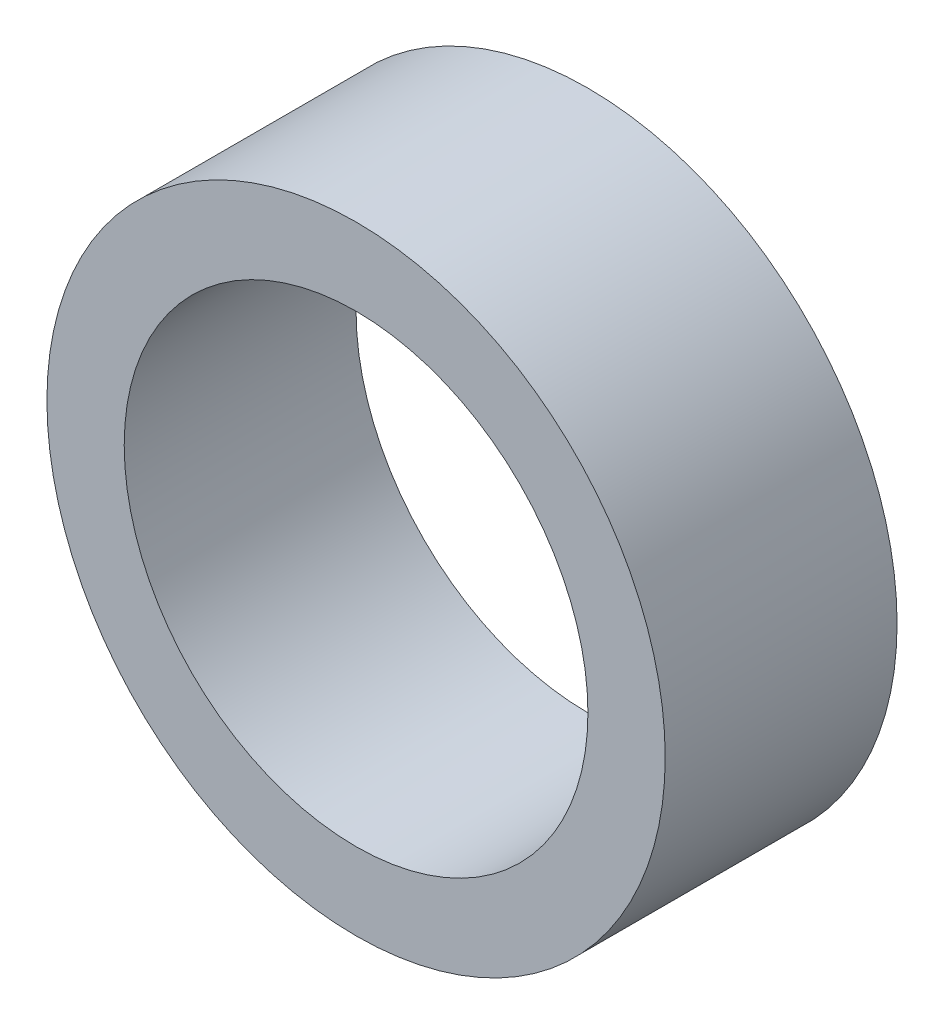
ISO-10303-21;
HEADER;
FILE_DESCRIPTION(('STEP AP214'),'2;1');
FILE_NAME('part.step','',(''),(''),'','','');
FILE_SCHEMA(('AUTOMOTIVE_DESIGN { 1 0 10303 214 1 1 1 1 }'));
ENDSEC;
DATA;
#1=APPLICATION_CONTEXT('core data for automotive mechanical design processes');
#2=APPLICATION_PROTOCOL_DEFINITION('international standard','automotive_design',2000,#1);
#3=PRODUCT_CONTEXT('',#1,'mechanical');
#4=PRODUCT('Part','Part','',(#3));
#5=PRODUCT_RELATED_PRODUCT_CATEGORY('part','',(#4));
#6=PRODUCT_DEFINITION_FORMATION('','',#4);
#7=PRODUCT_DEFINITION_CONTEXT('part definition',#1,'design');
#8=PRODUCT_DEFINITION('design','',#6,#7);
#9=PRODUCT_DEFINITION_SHAPE('','',#8);
#10=(LENGTH_UNIT() NAMED_UNIT(*) SI_UNIT(.MILLI.,.METRE.));
#11=(NAMED_UNIT(*) PLANE_ANGLE_UNIT() SI_UNIT($,.RADIAN.));
#12=(NAMED_UNIT(*) SI_UNIT($,.STERADIAN.) SOLID_ANGLE_UNIT());
#13=UNCERTAINTY_MEASURE_WITH_UNIT(LENGTH_MEASURE(1.E-05),#10,'distance_accuracy_value','');
#14=(GEOMETRIC_REPRESENTATION_CONTEXT(3) GLOBAL_UNCERTAINTY_ASSIGNED_CONTEXT((#13)) GLOBAL_UNIT_ASSIGNED_CONTEXT((#10,
#11,#12)) REPRESENTATION_CONTEXT('',''));
#15=CARTESIAN_POINT('',(0.,0.,0.));
#16=DIRECTION('',(0.,0.,1.));
#17=DIRECTION('',(1.,0.,0.));
#18=AXIS2_PLACEMENT_3D('',#15,#16,#17);
#19=CARTESIAN_POINT('',(0.,0.,4.7625));
#20=DIRECTION('',(0.,0.,1.));
#21=DIRECTION('',(1.,0.,0.));
#22=AXIS2_PLACEMENT_3D('',#19,#20,#21);
#23=PLANE('',#22);
#24=CARTESIAN_POINT('',(0.,0.,4.7625));
#25=DIRECTION('',(0.,0.,1.));
#26=DIRECTION('',(1.,0.,0.));
#27=AXIS2_PLACEMENT_3D('',#24,#25,#26);
#28=CIRCLE('',#27,12.7);
#29=CARTESIAN_POINT('',(12.7,0.,4.7625));
#30=VERTEX_POINT('',#29);
#31=EDGE_CURVE('E10',#30,#30,#28,.T.);
#32=ORIENTED_EDGE('',*,*,#31,.T.);
#33=EDGE_LOOP('',(#32));
#34=FACE_BOUND('',#33,.T.);
#35=CARTESIAN_POINT('',(0.,0.,4.7625));
#36=DIRECTION('',(0.,0.,1.));
#37=DIRECTION('',(1.,0.,0.));
#38=AXIS2_PLACEMENT_3D('',#35,#36,#37);
#39=CIRCLE('',#38,9.525);
#40=CARTESIAN_POINT('',(9.525,0.,4.7625));
#41=VERTEX_POINT('',#40);
#42=EDGE_CURVE('E45',#41,#41,#39,.T.);
#43=ORIENTED_EDGE('',*,*,#42,.F.);
#44=EDGE_LOOP('',(#43));
#45=FACE_BOUND('',#44,.T.);
#46=ADVANCED_FACE('F34',(#34,#45),#23,.T.);
#47=CARTESIAN_POINT('',(0.,0.,-4.7625));
#48=DIRECTION('',(0.,0.,1.));
#49=DIRECTION('',(1.,0.,0.));
#50=AXIS2_PLACEMENT_3D('',#47,#48,#49);
#51=PLANE('',#50);
#52=CARTESIAN_POINT('',(0.,0.,-4.7625));
#53=DIRECTION('',(0.,0.,1.));
#54=DIRECTION('',(1.,0.,0.));
#55=AXIS2_PLACEMENT_3D('',#52,#53,#54);
#56=CIRCLE('',#55,12.7);
#57=CARTESIAN_POINT('',(12.7,0.,-4.7625));
#58=VERTEX_POINT('',#57);
#59=EDGE_CURVE('E38',#58,#58,#56,.T.);
#60=ORIENTED_EDGE('',*,*,#59,.F.);
#61=EDGE_LOOP('',(#60));
#62=FACE_BOUND('',#61,.T.);
#63=CARTESIAN_POINT('',(0.,0.,-4.7625));
#64=DIRECTION('',(0.,0.,1.));
#65=DIRECTION('',(1.,0.,0.));
#66=AXIS2_PLACEMENT_3D('',#63,#64,#65);
#67=CIRCLE('',#66,9.525);
#68=CARTESIAN_POINT('',(9.525,0.,-4.7625));
#69=VERTEX_POINT('',#68);
#70=EDGE_CURVE('E47',#69,#69,#67,.T.);
#71=ORIENTED_EDGE('',*,*,#70,.T.);
#72=EDGE_LOOP('',(#71));
#73=FACE_BOUND('',#72,.T.);
#74=ADVANCED_FACE('F57',(#62,#73),#51,.F.);
#75=CARTESIAN_POINT('',(0.,0.,4.7625));
#76=DIRECTION('',(0.,0.,-1.));
#77=DIRECTION('',(-1.,0.,0.));
#78=AXIS2_PLACEMENT_3D('',#75,#76,#77);
#79=CYLINDRICAL_SURFACE('',#78,12.7);
#80=ORIENTED_EDGE('',*,*,#31,.F.);
#81=EDGE_LOOP('',(#80));
#82=FACE_BOUND('',#81,.T.);
#83=ORIENTED_EDGE('',*,*,#59,.T.);
#84=EDGE_LOOP('',(#83));
#85=FACE_BOUND('',#84,.T.);
#86=ADVANCED_FACE('F36',(#82,#85),#79,.T.);
#87=CARTESIAN_POINT('',(0.,0.,4.7625));
#88=DIRECTION('',(0.,0.,-1.));
#89=DIRECTION('',(-1.,0.,0.));
#90=AXIS2_PLACEMENT_3D('',#87,#88,#89);
#91=CYLINDRICAL_SURFACE('',#90,9.525);
#92=ORIENTED_EDGE('',*,*,#42,.T.);
#93=EDGE_LOOP('',(#92));
#94=FACE_BOUND('',#93,.T.);
#95=ORIENTED_EDGE('',*,*,#70,.F.);
#96=EDGE_LOOP('',(#95));
#97=FACE_BOUND('',#96,.T.);
#98=ADVANCED_FACE('F53',(#94,#97),#91,.F.);
#99=CLOSED_SHELL('',(#46,#74,#86,#98));
#100=MANIFOLD_SOLID_BREP('B2',#99);
#101=ADVANCED_BREP_SHAPE_REPRESENTATION('',(#18,#100),#14);
#102=SHAPE_DEFINITION_REPRESENTATION(#9,#101);
ENDSEC;
END-ISO-10303-21;
